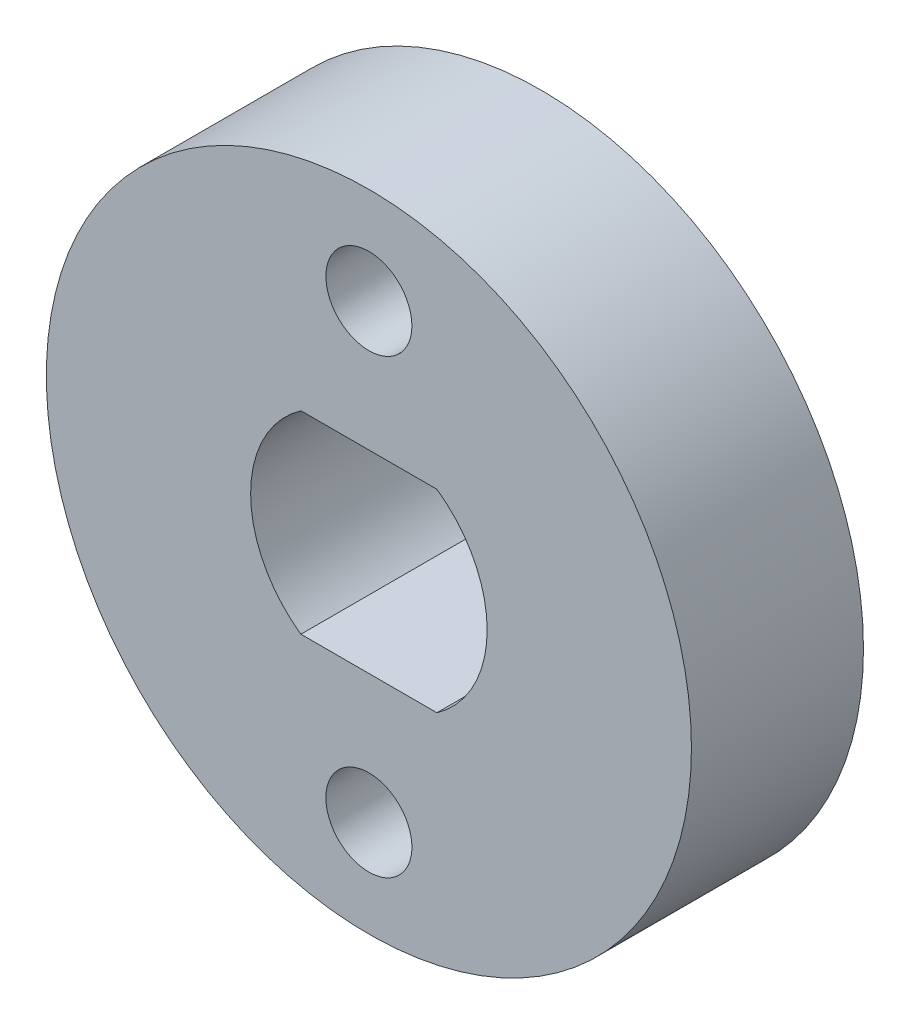
ISO-10303-21;
HEADER;
FILE_DESCRIPTION(('STEP AP214'),'2;1');
FILE_NAME('part.step','',(''),(''),'','','');
FILE_SCHEMA(('AUTOMOTIVE_DESIGN { 1 0 10303 214 1 1 1 1 }'));
ENDSEC;
DATA;
#1=APPLICATION_CONTEXT('core data for automotive mechanical design processes');
#2=APPLICATION_PROTOCOL_DEFINITION('international standard','automotive_design',2000,#1);
#3=PRODUCT_CONTEXT('',#1,'mechanical');
#4=PRODUCT('Part','Part','',(#3));
#5=PRODUCT_RELATED_PRODUCT_CATEGORY('part','',(#4));
#6=PRODUCT_DEFINITION_FORMATION('','',#4);
#7=PRODUCT_DEFINITION_CONTEXT('part definition',#1,'design');
#8=PRODUCT_DEFINITION('design','',#6,#7);
#9=PRODUCT_DEFINITION_SHAPE('','',#8);
#10=(LENGTH_UNIT() NAMED_UNIT(*) SI_UNIT(.MILLI.,.METRE.));
#11=(NAMED_UNIT(*) PLANE_ANGLE_UNIT() SI_UNIT($,.RADIAN.));
#12=(NAMED_UNIT(*) SI_UNIT($,.STERADIAN.) SOLID_ANGLE_UNIT());
#13=UNCERTAINTY_MEASURE_WITH_UNIT(LENGTH_MEASURE(1.E-05),#10,'distance_accuracy_value','');
#14=(GEOMETRIC_REPRESENTATION_CONTEXT(3) GLOBAL_UNCERTAINTY_ASSIGNED_CONTEXT((#13)) GLOBAL_UNIT_ASSIGNED_CONTEXT((#10,
#11,#12)) REPRESENTATION_CONTEXT('',''));
#15=CARTESIAN_POINT('',(0.,0.,0.));
#16=DIRECTION('',(0.,0.,1.));
#17=DIRECTION('',(1.,0.,0.));
#18=AXIS2_PLACEMENT_3D('',#15,#16,#17);
#19=CARTESIAN_POINT('',(0.,0.,4.));
#20=DIRECTION('',(0.,0.,-1.));
#21=DIRECTION('',(-1.,0.,0.));
#22=AXIS2_PLACEMENT_3D('',#19,#20,#21);
#23=CYLINDRICAL_SURFACE('',#22,7.5);
#24=CARTESIAN_POINT('',(0.,0.,4.));
#25=DIRECTION('',(0.,0.,1.));
#26=DIRECTION('',(1.,0.,0.));
#27=AXIS2_PLACEMENT_3D('',#24,#25,#26);
#28=CIRCLE('',#27,7.5);
#29=CARTESIAN_POINT('',(7.5,0.,4.));
#30=VERTEX_POINT('',#29);
#31=EDGE_CURVE('E11',#30,#30,#28,.T.);
#32=ORIENTED_EDGE('',*,*,#31,.F.);
#33=EDGE_LOOP('',(#32));
#34=FACE_BOUND('',#33,.T.);
#35=CARTESIAN_POINT('',(0.,0.,0.));
#36=DIRECTION('',(0.,0.,1.));
#37=DIRECTION('',(1.,0.,0.));
#38=AXIS2_PLACEMENT_3D('',#35,#36,#37);
#39=CIRCLE('',#38,7.5);
#40=CARTESIAN_POINT('',(7.5,0.,0.));
#41=VERTEX_POINT('',#40);
#42=EDGE_CURVE('E40',#41,#41,#39,.T.);
#43=ORIENTED_EDGE('',*,*,#42,.T.);
#44=EDGE_LOOP('',(#43));
#45=FACE_BOUND('',#44,.T.);
#46=ADVANCED_FACE('F37',(#34,#45),#23,.T.);
#47=CARTESIAN_POINT('',(0.,0.,4.));
#48=DIRECTION('',(0.,0.,1.));
#49=DIRECTION('',(1.,0.,0.));
#50=AXIS2_PLACEMENT_3D('',#47,#48,#49);
#51=PLANE('',#50);
#52=CARTESIAN_POINT('',(0.,-5.25,4.));
#53=DIRECTION('',(0.,0.,1.));
#54=DIRECTION('',(-1.,0.,0.));
#55=AXIS2_PLACEMENT_3D('',#52,#53,#54);
#56=CIRCLE('',#55,1.);
#57=CARTESIAN_POINT('',(-1.,-5.25,4.));
#58=VERTEX_POINT('',#57);
#59=EDGE_CURVE('E101',#58,#58,#56,.T.);
#60=ORIENTED_EDGE('',*,*,#59,.F.);
#61=EDGE_LOOP('',(#60));
#62=FACE_BOUND('',#61,.T.);
#63=CARTESIAN_POINT('',(0.,5.25,4.));
#64=DIRECTION('',(0.,0.,1.));
#65=DIRECTION('',(1.,0.,0.));
#66=AXIS2_PLACEMENT_3D('',#63,#64,#65);
#67=CIRCLE('',#66,1.);
#68=CARTESIAN_POINT('',(1.,5.25,4.));
#69=VERTEX_POINT('',#68);
#70=EDGE_CURVE('E168',#69,#69,#67,.T.);
#71=ORIENTED_EDGE('',*,*,#70,.F.);
#72=EDGE_LOOP('',(#71));
#73=FACE_BOUND('',#72,.T.);
#74=CARTESIAN_POINT('',(0.,0.,4.));
#75=DIRECTION('',(0.,0.,1.));
#76=DIRECTION('',(1.,0.,0.));
#77=AXIS2_PLACEMENT_3D('',#74,#75,#76);
#78=CIRCLE('',#77,2.75);
#79=CARTESIAN_POINT('',(-1.58113883008419,2.25,4.));
#80=VERTEX_POINT('',#79);
#81=CARTESIAN_POINT('',(-1.58113883008419,-2.25,4.));
#82=VERTEX_POINT('',#81);
#83=EDGE_CURVE('E51',#80,#82,#78,.T.);
#84=ORIENTED_EDGE('',*,*,#83,.F.);
#85=DIRECTION('',(-1.,0.,0.));
#86=VECTOR('',#85,1.);
#87=CARTESIAN_POINT('',(-1.58113883008419,2.25,4.));
#88=LINE('',#87,#86);
#89=CARTESIAN_POINT('',(1.58113883008419,2.25,4.));
#90=VERTEX_POINT('',#89);
#91=EDGE_CURVE('E95',#90,#80,#88,.T.);
#92=ORIENTED_EDGE('',*,*,#91,.F.);
#93=CARTESIAN_POINT('',(0.,0.,4.));
#94=DIRECTION('',(0.,0.,1.));
#95=DIRECTION('',(1.,0.,0.));
#96=AXIS2_PLACEMENT_3D('',#93,#94,#95);
#97=CIRCLE('',#96,2.75);
#98=CARTESIAN_POINT('',(1.58113883008419,-2.25,4.));
#99=VERTEX_POINT('',#98);
#100=EDGE_CURVE('E98',#99,#90,#97,.T.);
#101=ORIENTED_EDGE('',*,*,#100,.F.);
#102=DIRECTION('',(1.,0.,0.));
#103=VECTOR('',#102,1.);
#104=CARTESIAN_POINT('',(-1.58113883008419,-2.25,4.));
#105=LINE('',#104,#103);
#106=EDGE_CURVE('E107',#82,#99,#105,.T.);
#107=ORIENTED_EDGE('',*,*,#106,.F.);
#108=EDGE_LOOP('',(#84,#92,#101,#107));
#109=FACE_BOUND('',#108,.T.);
#110=ORIENTED_EDGE('',*,*,#31,.T.);
#111=EDGE_LOOP('',(#110));
#112=FACE_BOUND('',#111,.T.);
#113=ADVANCED_FACE('F120',(#62,#73,#109,#112),#51,.T.);
#114=CARTESIAN_POINT('',(0.,0.,0.));
#115=DIRECTION('',(0.,0.,1.));
#116=DIRECTION('',(1.,0.,0.));
#117=AXIS2_PLACEMENT_3D('',#114,#115,#116);
#118=PLANE('',#117);
#119=CARTESIAN_POINT('',(0.,-5.25,0.));
#120=DIRECTION('',(0.,0.,1.));
#121=DIRECTION('',(-1.,0.,0.));
#122=AXIS2_PLACEMENT_3D('',#119,#120,#121);
#123=CIRCLE('',#122,1.);
#124=CARTESIAN_POINT('',(-1.,-5.25,0.));
#125=VERTEX_POINT('',#124);
#126=EDGE_CURVE('E170',#125,#125,#123,.T.);
#127=ORIENTED_EDGE('',*,*,#126,.T.);
#128=EDGE_LOOP('',(#127));
#129=FACE_BOUND('',#128,.T.);
#130=CARTESIAN_POINT('',(0.,5.25,0.));
#131=DIRECTION('',(0.,0.,1.));
#132=DIRECTION('',(1.,0.,0.));
#133=AXIS2_PLACEMENT_3D('',#130,#131,#132);
#134=CIRCLE('',#133,1.);
#135=CARTESIAN_POINT('',(1.,5.25,0.));
#136=VERTEX_POINT('',#135);
#137=EDGE_CURVE('E108',#136,#136,#134,.T.);
#138=ORIENTED_EDGE('',*,*,#137,.T.);
#139=EDGE_LOOP('',(#138));
#140=FACE_BOUND('',#139,.T.);
#141=DIRECTION('',(-1.,0.,0.));
#142=VECTOR('',#141,1.);
#143=CARTESIAN_POINT('',(-1.58113883008419,2.25,0.));
#144=LINE('',#143,#142);
#145=CARTESIAN_POINT('',(1.58113883008419,2.25,0.));
#146=VERTEX_POINT('',#145);
#147=CARTESIAN_POINT('',(-1.58113883008419,2.25,0.));
#148=VERTEX_POINT('',#147);
#149=EDGE_CURVE('E85',#146,#148,#144,.T.);
#150=ORIENTED_EDGE('',*,*,#149,.T.);
#151=CARTESIAN_POINT('',(0.,0.,0.));
#152=DIRECTION('',(0.,0.,1.));
#153=DIRECTION('',(1.,0.,0.));
#154=AXIS2_PLACEMENT_3D('',#151,#152,#153);
#155=CIRCLE('',#154,2.75);
#156=CARTESIAN_POINT('',(-1.58113883008419,-2.25,0.));
#157=VERTEX_POINT('',#156);
#158=EDGE_CURVE('E79',#148,#157,#155,.T.);
#159=ORIENTED_EDGE('',*,*,#158,.T.);
#160=DIRECTION('',(1.,0.,0.));
#161=VECTOR('',#160,1.);
#162=CARTESIAN_POINT('',(-1.58113883008419,-2.25,0.));
#163=LINE('',#162,#161);
#164=CARTESIAN_POINT('',(1.58113883008419,-2.25,0.));
#165=VERTEX_POINT('',#164);
#166=EDGE_CURVE('E88',#157,#165,#163,.T.);
#167=ORIENTED_EDGE('',*,*,#166,.T.);
#168=CARTESIAN_POINT('',(0.,0.,0.));
#169=DIRECTION('',(0.,0.,1.));
#170=DIRECTION('',(1.,0.,0.));
#171=AXIS2_PLACEMENT_3D('',#168,#169,#170);
#172=CIRCLE('',#171,2.75);
#173=EDGE_CURVE('E59',#165,#146,#172,.T.);
#174=ORIENTED_EDGE('',*,*,#173,.T.);
#175=EDGE_LOOP('',(#150,#159,#167,#174));
#176=FACE_BOUND('',#175,.T.);
#177=ORIENTED_EDGE('',*,*,#42,.F.);
#178=EDGE_LOOP('',(#177));
#179=FACE_BOUND('',#178,.T.);
#180=ADVANCED_FACE('F92',(#129,#140,#176,#179),#118,.F.);
#181=CARTESIAN_POINT('',(0.,0.,0.));
#182=DIRECTION('',(0.,0.,1.));
#183=DIRECTION('',(1.,0.,0.));
#184=AXIS2_PLACEMENT_3D('',#181,#182,#183);
#185=CYLINDRICAL_SURFACE('',#184,2.75);
#186=ORIENTED_EDGE('',*,*,#83,.T.);
#187=DIRECTION('',(0.,0.,1.));
#188=VECTOR('',#187,1.);
#189=CARTESIAN_POINT('',(-1.58113883008419,-2.25,0.));
#190=LINE('',#189,#188);
#191=EDGE_CURVE('E75',#157,#82,#190,.T.);
#192=ORIENTED_EDGE('',*,*,#191,.F.);
#193=ORIENTED_EDGE('',*,*,#158,.F.);
#194=DIRECTION('',(0.,0.,1.));
#195=VECTOR('',#194,1.);
#196=CARTESIAN_POINT('',(-1.58113883008419,2.25,0.));
#197=LINE('',#196,#195);
#198=EDGE_CURVE('E112',#148,#80,#197,.T.);
#199=ORIENTED_EDGE('',*,*,#198,.T.);
#200=EDGE_LOOP('',(#186,#192,#193,#199));
#201=FACE_BOUND('',#200,.T.);
#202=ADVANCED_FACE('F77',(#201),#185,.F.);
#203=CARTESIAN_POINT('',(-1.58113883008419,2.25,0.));
#204=DIRECTION('',(0.,1.,0.));
#205=DIRECTION('',(0.,0.,1.));
#206=AXIS2_PLACEMENT_3D('',#203,#204,#205);
#207=PLANE('',#206);
#208=ORIENTED_EDGE('',*,*,#91,.T.);
#209=ORIENTED_EDGE('',*,*,#198,.F.);
#210=ORIENTED_EDGE('',*,*,#149,.F.);
#211=DIRECTION('',(0.,0.,1.));
#212=VECTOR('',#211,1.);
#213=CARTESIAN_POINT('',(1.58113883008419,2.25,0.));
#214=LINE('',#213,#212);
#215=EDGE_CURVE('E114',#146,#90,#214,.T.);
#216=ORIENTED_EDGE('',*,*,#215,.T.);
#217=EDGE_LOOP('',(#208,#209,#210,#216));
#218=FACE_BOUND('',#217,.T.);
#219=ADVANCED_FACE('F123',(#218),#207,.F.);
#220=CARTESIAN_POINT('',(0.,0.,0.));
#221=DIRECTION('',(0.,0.,1.));
#222=DIRECTION('',(1.,0.,0.));
#223=AXIS2_PLACEMENT_3D('',#220,#221,#222);
#224=CYLINDRICAL_SURFACE('',#223,2.75);
#225=ORIENTED_EDGE('',*,*,#100,.T.);
#226=ORIENTED_EDGE('',*,*,#215,.F.);
#227=ORIENTED_EDGE('',*,*,#173,.F.);
#228=DIRECTION('',(0.,0.,1.));
#229=VECTOR('',#228,1.);
#230=CARTESIAN_POINT('',(1.58113883008419,-2.25,0.));
#231=LINE('',#230,#229);
#232=EDGE_CURVE('E84',#165,#99,#231,.T.);
#233=ORIENTED_EDGE('',*,*,#232,.T.);
#234=EDGE_LOOP('',(#225,#226,#227,#233));
#235=FACE_BOUND('',#234,.T.);
#236=ADVANCED_FACE('F116',(#235),#224,.F.);
#237=CARTESIAN_POINT('',(-1.58113883008419,-2.25,0.));
#238=DIRECTION('',(0.,-1.,0.));
#239=DIRECTION('',(0.,0.,-1.));
#240=AXIS2_PLACEMENT_3D('',#237,#238,#239);
#241=PLANE('',#240);
#242=ORIENTED_EDGE('',*,*,#106,.T.);
#243=ORIENTED_EDGE('',*,*,#232,.F.);
#244=ORIENTED_EDGE('',*,*,#166,.F.);
#245=ORIENTED_EDGE('',*,*,#191,.T.);
#246=EDGE_LOOP('',(#242,#243,#244,#245));
#247=FACE_BOUND('',#246,.T.);
#248=ADVANCED_FACE('F89',(#247),#241,.F.);
#249=CARTESIAN_POINT('',(0.,5.25,0.));
#250=DIRECTION('',(0.,0.,1.));
#251=DIRECTION('',(1.,0.,0.));
#252=AXIS2_PLACEMENT_3D('',#249,#250,#251);
#253=CYLINDRICAL_SURFACE('',#252,1.);
#254=ORIENTED_EDGE('',*,*,#137,.F.);
#255=EDGE_LOOP('',(#254));
#256=FACE_BOUND('',#255,.T.);
#257=ORIENTED_EDGE('',*,*,#70,.T.);
#258=EDGE_LOOP('',(#257));
#259=FACE_BOUND('',#258,.T.);
#260=ADVANCED_FACE('F152',(#256,#259),#253,.F.);
#261=CARTESIAN_POINT('',(0.,-5.25,0.));
#262=DIRECTION('',(0.,0.,1.));
#263=DIRECTION('',(1.,0.,0.));
#264=AXIS2_PLACEMENT_3D('',#261,#262,#263);
#265=CYLINDRICAL_SURFACE('',#264,1.);
#266=ORIENTED_EDGE('',*,*,#126,.F.);
#267=EDGE_LOOP('',(#266));
#268=FACE_BOUND('',#267,.T.);
#269=ORIENTED_EDGE('',*,*,#59,.T.);
#270=EDGE_LOOP('',(#269));
#271=FACE_BOUND('',#270,.T.);
#272=ADVANCED_FACE('F156',(#268,#271),#265,.F.);
#273=CLOSED_SHELL('',(#46,#113,#180,#202,#219,#236,#248,#260,#272));
#274=MANIFOLD_SOLID_BREP('B2',#273);
#275=ADVANCED_BREP_SHAPE_REPRESENTATION('',(#18,#274),#14);
#276=SHAPE_DEFINITION_REPRESENTATION(#9,#275);
ENDSEC;
END-ISO-10303-21;
